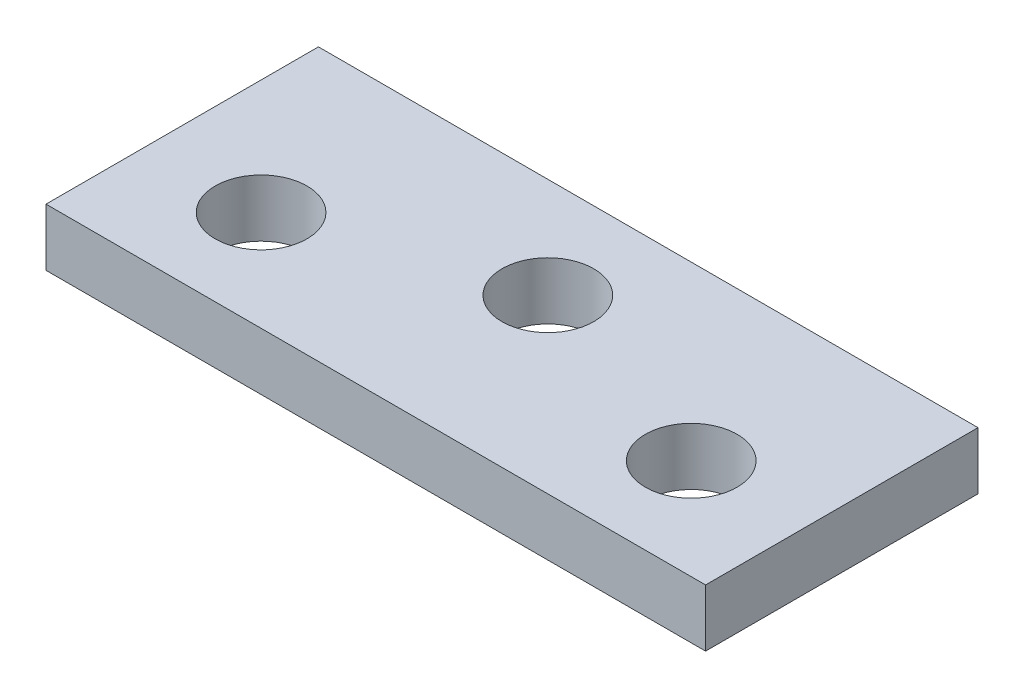
ISO-10303-21;
HEADER;
FILE_DESCRIPTION(('STEP AP214'),'2;1');
FILE_NAME('part.step','',(''),(''),'','','');
FILE_SCHEMA(('AUTOMOTIVE_DESIGN { 1 0 10303 214 1 1 1 1 }'));
ENDSEC;
DATA;
#1=APPLICATION_CONTEXT('core data for automotive mechanical design processes');
#2=APPLICATION_PROTOCOL_DEFINITION('international standard','automotive_design',2000,#1);
#3=PRODUCT_CONTEXT('',#1,'mechanical');
#4=PRODUCT('Part','Part','',(#3));
#5=PRODUCT_RELATED_PRODUCT_CATEGORY('part','',(#4));
#6=PRODUCT_DEFINITION_FORMATION('','',#4);
#7=PRODUCT_DEFINITION_CONTEXT('part definition',#1,'design');
#8=PRODUCT_DEFINITION('design','',#6,#7);
#9=PRODUCT_DEFINITION_SHAPE('','',#8);
#10=(LENGTH_UNIT() NAMED_UNIT(*) SI_UNIT(.MILLI.,.METRE.));
#11=(NAMED_UNIT(*) PLANE_ANGLE_UNIT() SI_UNIT($,.RADIAN.));
#12=(NAMED_UNIT(*) SI_UNIT($,.STERADIAN.) SOLID_ANGLE_UNIT());
#13=UNCERTAINTY_MEASURE_WITH_UNIT(LENGTH_MEASURE(1.E-05),#10,'distance_accuracy_value','');
#14=(GEOMETRIC_REPRESENTATION_CONTEXT(3) GLOBAL_UNCERTAINTY_ASSIGNED_CONTEXT((#13)) GLOBAL_UNIT_ASSIGNED_CONTEXT((#10,
#11,#12)) REPRESENTATION_CONTEXT('',''));
#15=CARTESIAN_POINT('',(0.,0.,0.));
#16=DIRECTION('',(0.,0.,1.));
#17=DIRECTION('',(1.,0.,0.));
#18=AXIS2_PLACEMENT_3D('',#15,#16,#17);
#19=CARTESIAN_POINT('',(-11.5,2.,4.75));
#20=DIRECTION('',(1.,0.,0.));
#21=DIRECTION('',(0.,0.,-1.));
#22=AXIS2_PLACEMENT_3D('',#19,#20,#21);
#23=PLANE('',#22);
#24=DIRECTION('',(0.,0.,1.));
#25=VECTOR('',#24,1.);
#26=CARTESIAN_POINT('',(-11.5,0.,4.75));
#27=LINE('',#26,#25);
#28=CARTESIAN_POINT('',(-11.5,0.,-4.75));
#29=VERTEX_POINT('',#28);
#30=CARTESIAN_POINT('',(-11.5,0.,4.75));
#31=VERTEX_POINT('',#30);
#32=EDGE_CURVE('E97',#29,#31,#27,.T.);
#33=ORIENTED_EDGE('',*,*,#32,.T.);
#34=DIRECTION('',(0.,-1.,0.));
#35=VECTOR('',#34,1.);
#36=CARTESIAN_POINT('',(-11.5,2.,4.75));
#37=LINE('',#36,#35);
#38=CARTESIAN_POINT('',(-11.5,2.,4.75));
#39=VERTEX_POINT('',#38);
#40=EDGE_CURVE('E11',#39,#31,#37,.T.);
#41=ORIENTED_EDGE('',*,*,#40,.F.);
#42=DIRECTION('',(0.,0.,1.));
#43=VECTOR('',#42,1.);
#44=CARTESIAN_POINT('',(-11.5,2.,4.75));
#45=LINE('',#44,#43);
#46=CARTESIAN_POINT('',(-11.5,2.,-4.75));
#47=VERTEX_POINT('',#46);
#48=EDGE_CURVE('E85',#47,#39,#45,.T.);
#49=ORIENTED_EDGE('',*,*,#48,.F.);
#50=DIRECTION('',(0.,-1.,0.));
#51=VECTOR('',#50,1.);
#52=CARTESIAN_POINT('',(-11.5,2.,-4.75));
#53=LINE('',#52,#51);
#54=EDGE_CURVE('E93',#47,#29,#53,.T.);
#55=ORIENTED_EDGE('',*,*,#54,.T.);
#56=EDGE_LOOP('',(#33,#41,#49,#55));
#57=FACE_BOUND('',#56,.T.);
#58=ADVANCED_FACE('F34',(#57),#23,.F.);
#59=CARTESIAN_POINT('',(11.5,2.,4.75));
#60=DIRECTION('',(0.,0.,-1.));
#61=DIRECTION('',(-1.,0.,0.));
#62=AXIS2_PLACEMENT_3D('',#59,#60,#61);
#63=PLANE('',#62);
#64=DIRECTION('',(1.,0.,0.));
#65=VECTOR('',#64,1.);
#66=CARTESIAN_POINT('',(11.5,0.,4.75));
#67=LINE('',#66,#65);
#68=CARTESIAN_POINT('',(11.5,0.,4.75));
#69=VERTEX_POINT('',#68);
#70=EDGE_CURVE('E89',#31,#69,#67,.T.);
#71=ORIENTED_EDGE('',*,*,#70,.T.);
#72=DIRECTION('',(0.,-1.,0.));
#73=VECTOR('',#72,1.);
#74=CARTESIAN_POINT('',(11.5,2.,4.75));
#75=LINE('',#74,#73);
#76=CARTESIAN_POINT('',(11.5,2.,4.75));
#77=VERTEX_POINT('',#76);
#78=EDGE_CURVE('E42',#77,#69,#75,.T.);
#79=ORIENTED_EDGE('',*,*,#78,.F.);
#80=DIRECTION('',(1.,0.,0.));
#81=VECTOR('',#80,1.);
#82=CARTESIAN_POINT('',(11.5,2.,4.75));
#83=LINE('',#82,#81);
#84=EDGE_CURVE('E80',#39,#77,#83,.T.);
#85=ORIENTED_EDGE('',*,*,#84,.F.);
#86=ORIENTED_EDGE('',*,*,#40,.T.);
#87=EDGE_LOOP('',(#71,#79,#85,#86));
#88=FACE_BOUND('',#87,.T.);
#89=ADVANCED_FACE('F88',(#88),#63,.F.);
#90=CARTESIAN_POINT('',(11.5,2.,4.75));
#91=DIRECTION('',(-1.,0.,0.));
#92=DIRECTION('',(0.,0.,1.));
#93=AXIS2_PLACEMENT_3D('',#90,#91,#92);
#94=PLANE('',#93);
#95=DIRECTION('',(0.,0.,-1.));
#96=VECTOR('',#95,1.);
#97=CARTESIAN_POINT('',(11.5,0.,4.75));
#98=LINE('',#97,#96);
#99=CARTESIAN_POINT('',(11.5,0.,-4.75));
#100=VERTEX_POINT('',#99);
#101=EDGE_CURVE('E67',#69,#100,#98,.T.);
#102=ORIENTED_EDGE('',*,*,#101,.T.);
#103=DIRECTION('',(0.,-1.,0.));
#104=VECTOR('',#103,1.);
#105=CARTESIAN_POINT('',(11.5,2.,-4.75));
#106=LINE('',#105,#104);
#107=CARTESIAN_POINT('',(11.5,2.,-4.75));
#108=VERTEX_POINT('',#107);
#109=EDGE_CURVE('E90',#108,#100,#106,.T.);
#110=ORIENTED_EDGE('',*,*,#109,.F.);
#111=DIRECTION('',(0.,0.,-1.));
#112=VECTOR('',#111,1.);
#113=CARTESIAN_POINT('',(11.5,2.,4.75));
#114=LINE('',#113,#112);
#115=EDGE_CURVE('E83',#77,#108,#114,.T.);
#116=ORIENTED_EDGE('',*,*,#115,.F.);
#117=ORIENTED_EDGE('',*,*,#78,.T.);
#118=EDGE_LOOP('',(#102,#110,#116,#117));
#119=FACE_BOUND('',#118,.T.);
#120=ADVANCED_FACE('F91',(#119),#94,.F.);
#121=CARTESIAN_POINT('',(11.5,2.,-4.75));
#122=DIRECTION('',(0.,0.,1.));
#123=DIRECTION('',(1.,0.,0.));
#124=AXIS2_PLACEMENT_3D('',#121,#122,#123);
#125=PLANE('',#124);
#126=DIRECTION('',(-1.,0.,0.));
#127=VECTOR('',#126,1.);
#128=CARTESIAN_POINT('',(11.5,0.,-4.75));
#129=LINE('',#128,#127);
#130=EDGE_CURVE('E73',#100,#29,#129,.T.);
#131=ORIENTED_EDGE('',*,*,#130,.T.);
#132=ORIENTED_EDGE('',*,*,#54,.F.);
#133=DIRECTION('',(-1.,0.,0.));
#134=VECTOR('',#133,1.);
#135=CARTESIAN_POINT('',(11.5,2.,-4.75));
#136=LINE('',#135,#134);
#137=EDGE_CURVE('E50',#108,#47,#136,.T.);
#138=ORIENTED_EDGE('',*,*,#137,.F.);
#139=ORIENTED_EDGE('',*,*,#109,.T.);
#140=EDGE_LOOP('',(#131,#132,#138,#139));
#141=FACE_BOUND('',#140,.T.);
#142=ADVANCED_FACE('F105',(#141),#125,.F.);
#143=CARTESIAN_POINT('',(0.,2.,0.));
#144=DIRECTION('',(0.,1.,0.));
#145=DIRECTION('',(0.,0.,1.));
#146=AXIS2_PLACEMENT_3D('',#143,#144,#145);
#147=PLANE('',#146);
#148=CARTESIAN_POINT('',(-7.5,2.,1.25));
#149=DIRECTION('',(0.,1.,0.));
#150=DIRECTION('',(0.,0.,1.));
#151=AXIS2_PLACEMENT_3D('',#148,#149,#150);
#152=CIRCLE('',#151,1.6);
#153=CARTESIAN_POINT('',(-7.5,2.,2.85));
#154=VERTEX_POINT('',#153);
#155=EDGE_CURVE('E123',#154,#154,#152,.T.);
#156=ORIENTED_EDGE('',*,*,#155,.F.);
#157=EDGE_LOOP('',(#156));
#158=FACE_BOUND('',#157,.T.);
#159=CARTESIAN_POINT('',(7.5,2.,1.25));
#160=DIRECTION('',(0.,1.,0.));
#161=DIRECTION('',(0.,0.,1.));
#162=AXIS2_PLACEMENT_3D('',#159,#160,#161);
#163=CIRCLE('',#162,1.6);
#164=CARTESIAN_POINT('',(7.5,2.,2.85));
#165=VERTEX_POINT('',#164);
#166=EDGE_CURVE('E117',#165,#165,#163,.T.);
#167=ORIENTED_EDGE('',*,*,#166,.F.);
#168=EDGE_LOOP('',(#167));
#169=FACE_BOUND('',#168,.T.);
#170=CARTESIAN_POINT('',(0.,2.,-1.25));
#171=DIRECTION('',(0.,1.,0.));
#172=DIRECTION('',(0.,0.,1.));
#173=AXIS2_PLACEMENT_3D('',#170,#171,#172);
#174=CIRCLE('',#173,1.6);
#175=CARTESIAN_POINT('',(0.,2.,0.349999999999997));
#176=VERTEX_POINT('',#175);
#177=EDGE_CURVE('E111',#176,#176,#174,.T.);
#178=ORIENTED_EDGE('',*,*,#177,.F.);
#179=EDGE_LOOP('',(#178));
#180=FACE_BOUND('',#179,.T.);
#181=ORIENTED_EDGE('',*,*,#48,.T.);
#182=ORIENTED_EDGE('',*,*,#84,.T.);
#183=ORIENTED_EDGE('',*,*,#115,.T.);
#184=ORIENTED_EDGE('',*,*,#137,.T.);
#185=EDGE_LOOP('',(#181,#182,#183,#184));
#186=FACE_BOUND('',#185,.T.);
#187=ADVANCED_FACE('F81',(#158,#169,#180,#186),#147,.T.);
#188=CARTESIAN_POINT('',(0.,0.,0.));
#189=DIRECTION('',(0.,1.,0.));
#190=DIRECTION('',(0.,0.,1.));
#191=AXIS2_PLACEMENT_3D('',#188,#189,#190);
#192=PLANE('',#191);
#193=CARTESIAN_POINT('',(-7.5,0.,1.25));
#194=DIRECTION('',(0.,1.,0.));
#195=DIRECTION('',(0.,0.,1.));
#196=AXIS2_PLACEMENT_3D('',#193,#194,#195);
#197=CIRCLE('',#196,1.6);
#198=CARTESIAN_POINT('',(-7.5,0.,2.85));
#199=VERTEX_POINT('',#198);
#200=EDGE_CURVE('E100',#199,#199,#197,.T.);
#201=ORIENTED_EDGE('',*,*,#200,.T.);
#202=EDGE_LOOP('',(#201));
#203=FACE_BOUND('',#202,.T.);
#204=CARTESIAN_POINT('',(7.5,0.,1.25));
#205=DIRECTION('',(0.,1.,0.));
#206=DIRECTION('',(0.,0.,1.));
#207=AXIS2_PLACEMENT_3D('',#204,#205,#206);
#208=CIRCLE('',#207,1.6);
#209=CARTESIAN_POINT('',(7.5,0.,2.85));
#210=VERTEX_POINT('',#209);
#211=EDGE_CURVE('E120',#210,#210,#208,.T.);
#212=ORIENTED_EDGE('',*,*,#211,.T.);
#213=EDGE_LOOP('',(#212));
#214=FACE_BOUND('',#213,.T.);
#215=CARTESIAN_POINT('',(0.,0.,-1.25));
#216=DIRECTION('',(0.,1.,0.));
#217=DIRECTION('',(0.,0.,1.));
#218=AXIS2_PLACEMENT_3D('',#215,#216,#217);
#219=CIRCLE('',#218,1.6);
#220=CARTESIAN_POINT('',(0.,0.,0.349999999999997));
#221=VERTEX_POINT('',#220);
#222=EDGE_CURVE('E114',#221,#221,#219,.T.);
#223=ORIENTED_EDGE('',*,*,#222,.T.);
#224=EDGE_LOOP('',(#223));
#225=FACE_BOUND('',#224,.T.);
#226=ORIENTED_EDGE('',*,*,#32,.F.);
#227=ORIENTED_EDGE('',*,*,#130,.F.);
#228=ORIENTED_EDGE('',*,*,#101,.F.);
#229=ORIENTED_EDGE('',*,*,#70,.F.);
#230=EDGE_LOOP('',(#226,#227,#228,#229));
#231=FACE_BOUND('',#230,.T.);
#232=ADVANCED_FACE('F108',(#203,#214,#225,#231),#192,.F.);
#233=CARTESIAN_POINT('',(0.,0.,-1.25));
#234=DIRECTION('',(0.,1.,0.));
#235=DIRECTION('',(0.,0.,1.));
#236=AXIS2_PLACEMENT_3D('',#233,#234,#235);
#237=CYLINDRICAL_SURFACE('',#236,1.6);
#238=ORIENTED_EDGE('',*,*,#222,.F.);
#239=EDGE_LOOP('',(#238));
#240=FACE_BOUND('',#239,.T.);
#241=ORIENTED_EDGE('',*,*,#177,.T.);
#242=EDGE_LOOP('',(#241));
#243=FACE_BOUND('',#242,.T.);
#244=ADVANCED_FACE('F145',(#240,#243),#237,.F.);
#245=CARTESIAN_POINT('',(7.5,0.,1.25));
#246=DIRECTION('',(0.,1.,0.));
#247=DIRECTION('',(0.,0.,1.));
#248=AXIS2_PLACEMENT_3D('',#245,#246,#247);
#249=CYLINDRICAL_SURFACE('',#248,1.6);
#250=ORIENTED_EDGE('',*,*,#211,.F.);
#251=EDGE_LOOP('',(#250));
#252=FACE_BOUND('',#251,.T.);
#253=ORIENTED_EDGE('',*,*,#166,.T.);
#254=EDGE_LOOP('',(#253));
#255=FACE_BOUND('',#254,.T.);
#256=ADVANCED_FACE('F134',(#252,#255),#249,.F.);
#257=CARTESIAN_POINT('',(-7.5,0.,1.25));
#258=DIRECTION('',(0.,1.,0.));
#259=DIRECTION('',(0.,0.,1.));
#260=AXIS2_PLACEMENT_3D('',#257,#258,#259);
#261=CYLINDRICAL_SURFACE('',#260,1.6);
#262=ORIENTED_EDGE('',*,*,#200,.F.);
#263=EDGE_LOOP('',(#262));
#264=FACE_BOUND('',#263,.T.);
#265=ORIENTED_EDGE('',*,*,#155,.T.);
#266=EDGE_LOOP('',(#265));
#267=FACE_BOUND('',#266,.T.);
#268=ADVANCED_FACE('F131',(#264,#267),#261,.F.);
#269=CLOSED_SHELL('',(#58,#89,#120,#142,#187,#232,#244,#256,#268));
#270=MANIFOLD_SOLID_BREP('B2',#269);
#271=ADVANCED_BREP_SHAPE_REPRESENTATION('',(#18,#270),#14);
#272=SHAPE_DEFINITION_REPRESENTATION(#9,#271);
ENDSEC;
END-ISO-10303-21;
